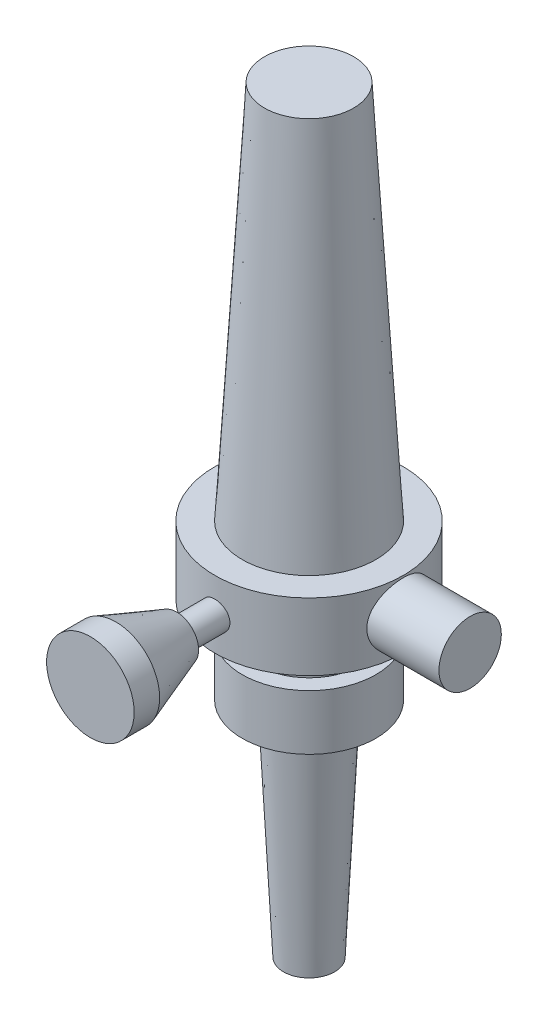
ISO-10303-21;
HEADER;
FILE_DESCRIPTION(('STEP AP214'),'2;1');
FILE_NAME('part.step','',(''),(''),'','','');
FILE_SCHEMA(('AUTOMOTIVE_DESIGN { 1 0 10303 214 1 1 1 1 }'));
ENDSEC;
DATA;
#1=APPLICATION_CONTEXT('core data for automotive mechanical design processes');
#2=APPLICATION_PROTOCOL_DEFINITION('international standard','automotive_design',2000,#1);
#3=PRODUCT_CONTEXT('',#1,'mechanical');
#4=PRODUCT('Part','Part','',(#3));
#5=PRODUCT_RELATED_PRODUCT_CATEGORY('part','',(#4));
#6=PRODUCT_DEFINITION_FORMATION('','',#4);
#7=PRODUCT_DEFINITION_CONTEXT('part definition',#1,'design');
#8=PRODUCT_DEFINITION('design','',#6,#7);
#9=PRODUCT_DEFINITION_SHAPE('','',#8);
#10=(LENGTH_UNIT() NAMED_UNIT(*) SI_UNIT(.MILLI.,.METRE.));
#11=(NAMED_UNIT(*) PLANE_ANGLE_UNIT() SI_UNIT($,.RADIAN.));
#12=(NAMED_UNIT(*) SI_UNIT($,.STERADIAN.) SOLID_ANGLE_UNIT());
#13=UNCERTAINTY_MEASURE_WITH_UNIT(LENGTH_MEASURE(1.E-05),#10,'distance_accuracy_value','');
#14=(GEOMETRIC_REPRESENTATION_CONTEXT(3) GLOBAL_UNCERTAINTY_ASSIGNED_CONTEXT((#13)) GLOBAL_UNIT_ASSIGNED_CONTEXT((#10,
#11,#12)) REPRESENTATION_CONTEXT('',''));
#15=CARTESIAN_POINT('',(0.,0.,0.));
#16=DIRECTION('',(0.,0.,1.));
#17=DIRECTION('',(1.,0.,0.));
#18=AXIS2_PLACEMENT_3D('',#15,#16,#17);
#19=CARTESIAN_POINT('',(0.,0.,0.));
#20=DIRECTION('',(0.,-1.,0.));
#21=DIRECTION('',(0.,0.,-1.));
#22=AXIS2_PLACEMENT_3D('',#19,#20,#21);
#23=CYLINDRICAL_SURFACE('',#22,21.1480362537765);
#24=CARTESIAN_POINT('',(0.,69.6374622356495,0.));
#25=DIRECTION('',(0.,-1.,0.));
#26=DIRECTION('',(0.,0.,-1.));
#27=AXIS2_PLACEMENT_3D('',#24,#25,#26);
#28=CIRCLE('',#27,21.1480362537765);
#29=CARTESIAN_POINT('',(0.,69.6374622356495,-21.1480362537765));
#30=VERTEX_POINT('',#29);
#31=EDGE_CURVE('E97',#30,#30,#28,.T.);
#32=ORIENTED_EDGE('',*,*,#31,.F.);
#33=EDGE_LOOP('',(#32));
#34=FACE_BOUND('',#33,.T.);
#35=CARTESIAN_POINT('',(0.,84.7432024169184,0.));
#36=DIRECTION('',(0.,-1.,0.));
#37=DIRECTION('',(0.,0.,-1.));
#38=AXIS2_PLACEMENT_3D('',#35,#36,#37);
#39=CIRCLE('',#38,21.1480362537765);
#40=CARTESIAN_POINT('',(0.,84.7432024169184,-21.1480362537765));
#41=VERTEX_POINT('',#40);
#42=EDGE_CURVE('E101',#41,#41,#39,.T.);
#43=ORIENTED_EDGE('',*,*,#42,.T.);
#44=EDGE_LOOP('',(#43));
#45=FACE_BOUND('',#44,.T.);
#46=CARTESIAN_POINT('',(19.9559373969514,77.2982046196616,-7.00000000000001));
#47=CARTESIAN_POINT('',(19.9559373637599,77.4888937471689,-7.00000004484916));
#48=CARTESIAN_POINT('',(19.9586779929174,77.6795822624436,-6.9922016010183));
#49=CARTESIAN_POINT('',(19.9695536737059,78.0596018697949,-6.96107993234545));
#50=CARTESIAN_POINT('',(19.9776907054776,78.2489324378032,-6.93775100878092));
#51=CARTESIAN_POINT('',(19.9990979329826,78.6247295937406,-6.87579740289146));
#52=CARTESIAN_POINT('',(20.0123669263519,78.8111968418836,-6.83717630331018));
#53=CARTESIAN_POINT('',(20.0436285211008,79.1800646362831,-6.74498031053922));
#54=CARTESIAN_POINT('',(20.0616229616517,79.3624635690738,-6.69139959446706));
#55=CARTESIAN_POINT('',(20.1017382328248,79.7214653658894,-6.56990377930406));
#56=CARTESIAN_POINT('',(20.1238492537978,79.8980808589257,-6.50202270783766));
#57=CARTESIAN_POINT('',(20.1715876785788,80.2449028196239,-6.35237389394031));
#58=CARTESIAN_POINT('',(20.1972163183844,80.4151070076145,-6.27060126797565));
#59=CARTESIAN_POINT('',(20.2512620809007,80.7480103280121,-6.09379701007682));
#60=CARTESIAN_POINT('',(20.2796791434273,80.9107096222904,-5.99876566429482));
#61=CARTESIAN_POINT('',(20.3385321573016,81.2276714880433,-5.79609170224928));
#62=CARTESIAN_POINT('',(20.3689681891219,81.3819337227836,-5.68844858317102));
#63=CARTESIAN_POINT('',(20.4321530678057,81.6864158496573,-5.45723536209075));
#64=CARTESIAN_POINT('',(20.4649456128122,81.8363024441764,-5.33323807722372));
#65=CARTESIAN_POINT('',(20.5309290902304,82.1251478041543,-5.07329866187998));
#66=CARTESIAN_POINT('',(20.5641198960406,82.2641099415435,-4.93736024478751));
#67=CARTESIAN_POINT('',(20.6300357875734,82.5303732791057,-4.65426563823532));
#68=CARTESIAN_POINT('',(20.6627606292505,82.6576685457874,-4.50710380975606));
#69=CARTESIAN_POINT('',(20.7268438567156,82.8996535177027,-4.20256840370738));
#70=CARTESIAN_POINT('',(20.7582027416977,83.0143478517216,-4.04519860991114));
#71=CARTESIAN_POINT('',(20.8195246610451,83.2332275946416,-3.71691139843195));
#72=CARTESIAN_POINT('',(20.8494297520908,83.3370597759228,-3.54574732704238));
#73=CARTESIAN_POINT('',(20.9060802019251,83.5298369008791,-3.19481185251223));
#74=CARTESIAN_POINT('',(20.9328267297266,83.618787357527,-3.01504366866843));
#75=CARTESIAN_POINT('',(20.9824067913964,83.7810999844541,-2.64807812748758));
#76=CARTESIAN_POINT('',(21.0052403596026,83.8544622915271,-2.4608808353617));
#77=CARTESIAN_POINT('',(21.0463275934686,83.9849306654893,-2.0804165842432));
#78=CARTESIAN_POINT('',(21.0645814522678,84.0420374179349,-1.88714988160167));
#79=CARTESIAN_POINT('',(21.0954288302058,84.1377705129084,-1.50273621475997));
#80=CARTESIAN_POINT('',(21.1081951669636,84.1769640218881,-1.31174428259691));
#81=CARTESIAN_POINT('',(21.1285928555165,84.2393045832623,-0.926890816979917));
#82=CARTESIAN_POINT('',(21.1362244092708,84.2624522667652,-0.733029396693999));
#83=CARTESIAN_POINT('',(21.1461342638489,84.2924706969404,-0.34395463661358));
#84=CARTESIAN_POINT('',(21.1484136860879,84.2993448533557,-0.148741588620104));
#85=CARTESIAN_POINT('',(21.1475569722391,84.296756681366,0.241562029615043));
#86=CARTESIAN_POINT('',(21.1444209595862,84.2872947253124,0.436652602546915));
#87=CARTESIAN_POINT('',(21.1330502234635,84.2528163486098,0.817634618483673));
#88=CARTESIAN_POINT('',(21.125018662614,84.2284195503306,1.00358860806514));
#89=CARTESIAN_POINT('',(21.1042458340637,84.1648382554546,1.37274672971014));
#90=CARTESIAN_POINT('',(21.0915030018603,84.1256488464879,1.55594992724611));
#91=CARTESIAN_POINT('',(21.0616440786545,84.0328420625132,1.91823210436545));
#92=CARTESIAN_POINT('',(21.0445293974661,83.9792293383738,2.09731239322902));
#93=CARTESIAN_POINT('',(21.0063556102135,83.8579948442711,2.45030452587248));
#94=CARTESIAN_POINT('',(20.9852950162514,83.7903677888557,2.62421439126833));
#95=CARTESIAN_POINT('',(20.9394746788614,83.6407040943251,2.96787291117415));
#96=CARTESIAN_POINT('',(20.9146714690165,83.5584958259969,3.1375409823403));
#97=CARTESIAN_POINT('',(20.8621873903389,83.380854172662,3.46941091827831));
#98=CARTESIAN_POINT('',(20.8345055373844,83.2854162610991,3.63161020217272));
#99=CARTESIAN_POINT('',(20.7769617757717,83.0819938863844,3.94754130845921));
#100=CARTESIAN_POINT('',(20.7470997494026,82.9740087456018,4.10127267286785));
#101=CARTESIAN_POINT('',(20.6859364882821,82.7461922172031,4.39938951856267));
#102=CARTESIAN_POINT('',(20.6546352019396,82.6263604047584,4.54377466438042));
#103=CARTESIAN_POINT('',(20.5898903890692,82.3697206287913,4.82889320136418));
#104=CARTESIAN_POINT('',(20.5564150666576,82.2323813519303,4.96914156102592));
#105=CARTESIAN_POINT('',(20.4896606362824,81.9464378687057,5.23759243927183));
#106=CARTESIAN_POINT('',(20.4563814700175,81.7978372124598,5.36579872577825));
#107=CARTESIAN_POINT('',(20.3909136665423,81.4901639644254,5.60945660610016));
#108=CARTESIAN_POINT('',(20.3587256077934,81.3310859455199,5.72490150546052));
#109=CARTESIAN_POINT('',(20.2963872444599,81.003569314128,5.94212675949166));
#110=CARTESIAN_POINT('',(20.2662361472778,80.8351343895197,6.04391244445343));
#111=CARTESIAN_POINT('',(20.2084324139366,80.4874216885632,6.23448144910379));
#112=CARTESIAN_POINT('',(20.1808218535512,80.3080229767062,6.32305715828977));
#113=CARTESIAN_POINT('',(20.1294742890931,79.9419007049154,6.48466607647832));
#114=CARTESIAN_POINT('',(20.1057357774562,79.7551800310457,6.55770533790883));
#115=CARTESIAN_POINT('',(20.0628986145188,79.3757015430293,6.68761687963633));
#116=CARTESIAN_POINT('',(20.0437993328143,79.1829445531536,6.74449135667152));
#117=CARTESIAN_POINT('',(20.0108863460982,78.7928278317901,6.84152736591956));
#118=CARTESIAN_POINT('',(19.9970723730587,78.5954683342427,6.88168974564271));
#119=CARTESIAN_POINT('',(19.9756998085786,78.2065800845066,6.94347701920437));
#120=CARTESIAN_POINT('',(19.967889865247,78.0151834860789,6.96584831938366));
#121=CARTESIAN_POINT('',(19.957789716661,77.6310545463855,6.99473402897629));
#122=CARTESIAN_POINT('',(19.9554993204621,77.4383222515586,7.00124898692786));
#123=CARTESIAN_POINT('',(19.9565137568215,77.0530235910814,6.99835678192027));
#124=CARTESIAN_POINT('',(19.9598177100769,76.8604572041139,6.98895212115882));
#125=CARTESIAN_POINT('',(19.9719101337549,76.4769289910405,6.95432084376154));
#126=CARTESIAN_POINT('',(19.9806985385103,76.2859671457507,6.92909441656514));
#127=CARTESIAN_POINT('',(20.003085405099,75.913512942001,6.86419282679363));
#128=CARTESIAN_POINT('',(20.0165104175256,75.7319192094865,6.82503732992255));
#129=CARTESIAN_POINT('',(20.047815720765,75.3727169342371,6.73252589702901));
#130=CARTESIAN_POINT('',(20.0656974880091,75.1951097334549,6.67916525473421));
#131=CARTESIAN_POINT('',(20.1053930666561,74.8451205381705,6.55870591910714));
#132=CARTESIAN_POINT('',(20.1272059927388,74.6727373773733,6.49161031850786));
#133=CARTESIAN_POINT('',(20.1741670010292,74.3341355999493,6.34416329987665));
#134=CARTESIAN_POINT('',(20.1993163491347,74.1679193539442,6.26380684760506));
#135=CARTESIAN_POINT('',(20.2530898959137,73.8376290610114,6.08773500930357));
#136=CARTESIAN_POINT('',(20.2817976769767,73.6737813546366,5.99162055339831));
#137=CARTESIAN_POINT('',(20.3412526666089,73.3546380817074,5.78655971130735));
#138=CARTESIAN_POINT('',(20.3720005773841,73.1993454938123,5.6776088967749));
#139=CARTESIAN_POINT('',(20.434709909501,72.8982478755281,5.44759351973777));
#140=CARTESIAN_POINT('',(20.4666714360303,72.752443670511,5.32652790571386));
#141=CARTESIAN_POINT('',(20.5309754526817,72.4711697828601,5.0730249286601));
#142=CARTESIAN_POINT('',(20.5633179514474,72.3357003352277,4.94058730718839));
#143=CARTESIAN_POINT('',(20.6290883975114,72.0697017183525,4.65855085393182));
#144=CARTESIAN_POINT('',(20.6624947569551,71.9397144226995,4.50843527784129));
#145=CARTESIAN_POINT('',(20.7278818484522,71.6928667456271,4.19756690649508));
#146=CARTESIAN_POINT('',(20.7598630541424,71.5760019831317,4.03681769002913));
#147=CARTESIAN_POINT('',(20.8215376495565,71.3561398162088,3.7055892415214));
#148=CARTESIAN_POINT('',(20.8512301713903,71.2531476614441,3.53510636062765));
#149=CARTESIAN_POINT('',(20.907471570298,71.0619171244199,3.18565091992499));
#150=CARTESIAN_POINT('',(20.9340217627325,70.9736725624849,3.00668195659526));
#151=CARTESIAN_POINT('',(20.983084615014,70.8131286532845,2.64256081461425));
#152=CARTESIAN_POINT('',(21.0056216927307,70.7407322126224,2.45745477371229));
#153=CARTESIAN_POINT('',(21.0462117730759,70.6118502281801,2.08138337487872));
#154=CARTESIAN_POINT('',(21.0642665649707,70.5553583343147,1.89042038927152));
#155=CARTESIAN_POINT('',(21.095377986611,70.4587875032574,1.50400458249787));
#156=CARTESIAN_POINT('',(21.1084350862752,70.4187070229228,1.30855218529066));
#157=CARTESIAN_POINT('',(21.1291674405928,70.3553537309523,0.914662232441492));
#158=CARTESIAN_POINT('',(21.1368429230297,70.3320802079405,0.716224803507784));
#159=CARTESIAN_POINT('',(21.1463580940051,70.3032639043389,0.327205159928276));
#160=CARTESIAN_POINT('',(21.1484522023549,70.2969480259067,0.136686029378245));
#161=CARTESIAN_POINT('',(21.1474836114066,70.2998741910217,-0.244218361675259));
#162=CARTESIAN_POINT('',(21.1444210122582,70.3091159324203,-0.434603624706769));
#163=CARTESIAN_POINT('',(21.1332230538325,70.3430673258253,-0.81382009702638));
#164=CARTESIAN_POINT('',(21.1250881319468,70.3677756441334,-1.00265143888834));
#165=CARTESIAN_POINT('',(21.1039665099362,70.4324273636597,-1.37741024457641));
#166=CARTESIAN_POINT('',(21.0909797967454,70.4723708059061,-1.56333770058095));
#167=CARTESIAN_POINT('',(21.060742417381,70.566386105284,-1.92809068276906));
#168=CARTESIAN_POINT('',(21.0435619248806,70.6202262067469,-2.10698188769946));
#169=CARTESIAN_POINT('',(21.0052704664872,70.7418883437027,-2.45957525007892));
#170=CARTESIAN_POINT('',(20.9841581841774,70.8097150629242,-2.63327564690435));
#171=CARTESIAN_POINT('',(20.9385421127019,70.9587929216181,-2.97430399140375));
#172=CARTESIAN_POINT('',(20.9140390617907,71.0400411396406,-3.14163331613342));
#173=CARTESIAN_POINT('',(20.8622332515255,71.2154127545409,-3.46902634655464));
#174=CARTESIAN_POINT('',(20.8349294347073,71.3095410189541,-3.62908727482213));
#175=CARTESIAN_POINT('',(20.7771642992392,71.5136525425391,-3.94662640487891));
#176=CARTESIAN_POINT('',(20.7466243733494,71.6240870597535,-4.10380033070715));
#177=CARTESIAN_POINT('',(20.6840401102884,71.857367839146,-4.4084138357924));
#178=CARTESIAN_POINT('',(20.6519952521509,71.9802184166322,-4.55585000096469));
#179=CARTESIAN_POINT('',(20.5872357617519,72.2375384509375,-4.84008395726412));
#180=CARTESIAN_POINT('',(20.5545210453462,72.3720093743598,-4.9768804014007));
#181=CARTESIAN_POINT('',(20.4892785475544,72.6517442535129,-5.23900255332245));
#182=CARTESIAN_POINT('',(20.4567507683797,72.7970083366444,-5.36432812566817));
#183=CARTESIAN_POINT('',(20.3915040837562,73.1032979429075,-5.60735580193406));
#184=CARTESIAN_POINT('',(20.3588265190773,73.2647159136305,-5.72457502369865));
#185=CARTESIAN_POINT('',(20.2955728563247,73.5971966378364,-5.94493914745524));
#186=CARTESIAN_POINT('',(20.2649960172489,73.7682559513057,-6.04808902499806));
#187=CARTESIAN_POINT('',(20.2068524613687,74.1189976352126,-6.23959710495749));
#188=CARTESIAN_POINT('',(20.179286265375,74.2986814898937,-6.32795274952701));
#189=CARTESIAN_POINT('',(20.1280505279008,74.6653526009609,-6.48908084639975));
#190=CARTESIAN_POINT('',(20.1043792289109,74.8523365159256,-6.5618603316755));
#191=CARTESIAN_POINT('',(20.0627503618983,75.2229404402756,-6.68802499635103));
#192=CARTESIAN_POINT('',(20.0445681125482,75.4062694691628,-6.74219133160252));
#193=CARTESIAN_POINT('',(20.0129759763534,75.7770636098071,-6.83539722943484));
#194=CARTESIAN_POINT('',(19.9995641305416,75.9645269901276,-6.87444300186397));
#195=CARTESIAN_POINT('',(19.9779287343544,76.3423001476716,-6.93706719075487));
#196=CARTESIAN_POINT('',(19.9697046907328,76.5326096525292,-6.9606470776921));
#197=CARTESIAN_POINT('',(19.9587090352451,76.9146811832899,-6.99211346976687));
#198=CARTESIAN_POINT('',(19.9559374303296,77.1064432110444,-6.99999995489866));
#199=CARTESIAN_POINT('',(19.9559373969514,77.2982046196616,-7.00000000000001));
#200=B_SPLINE_CURVE_WITH_KNOTS('',3,(#46,#47,#48,#49,#50,#51,#52,#53,#54,#55,#56,#57,#58,#59,
#60,#61,#62,#63,#64,#65,#66,#67,#68,#69,#70,#71,#72,#73,#74,#75,#76,#77,#78,#79,#80,#81,#82,#83,
#84,#85,#86,#87,#88,#89,#90,#91,#92,#93,#94,#95,#96,#97,#98,#99,#100,#101,#102,#103,#104,#105,
#106,#107,#108,#109,#110,#111,#112,#113,#114,#115,#116,#117,#118,#119,#120,#121,#122,#123,#124,
#125,#126,#127,#128,#129,#130,#131,#132,#133,#134,#135,#136,#137,#138,#139,#140,#141,#142,#143,
#144,#145,#146,#147,#148,#149,#150,#151,#152,#153,#154,#155,#156,#157,#158,#159,#160,#161,#162,
#163,#164,#165,#166,#167,#168,#169,#170,#171,#172,#173,#174,#175,#176,#177,#178,#179,#180,#181,
#182,#183,#184,#185,#186,#187,#188,#189,#190,#191,#192,#193,#194,#195,#196,#197,#198,#199),
.UNSPECIFIED.,.T.,.F.,(4,2,2,2,2,2,2,2,2,2,2,2,2,2,2,2,2,2,2,2,2,2,2,2,2,2,2,2,2,2,2,2,2,2,2,2,
2,2,2,2,2,2,2,2,2,2,2,2,2,2,2,2,2,2,2,2,2,2,2,2,2,2,2,2,2,2,2,2,2,2,2,2,2,2,2,2,4),(0.,
0.571888234902402,1.14398643305778,1.71595067581447,2.28813786111064,2.85897860500491,
3.43002044308372,4.00104995873719,4.57210224833401,5.16325059942811,5.7542157650496,
6.3454798327393,6.93652597606646,7.5430275700796,8.14930398413311,8.75557507759277,
9.36182059858849,9.94725216686042,10.5326607078444,11.1179465790811,11.7032191099862,
12.2657160689868,12.8283999880586,13.3909026839645,13.9536179129937,14.5234590158855,
15.093495574831,15.6635629337252,16.2336507429946,16.8303485583596,17.4268590427423,
18.0236809783248,18.6202693321502,19.2254212239314,19.8303369373185,20.4351704054067,
21.039973197208,21.6178210382798,22.195648888856,22.7733859266247,23.3511160470826,
23.9092302604818,24.4675296119714,25.0257033878871,25.5840895537959,26.1597945965385,
26.7356988334651,27.3116531001512,27.8876204595221,28.4909966017767,29.0941706987385,
29.6975724109886,30.300720642736,30.9000633081885,31.4991663382756,32.0982130225837,
32.6972343499901,33.2684419148391,33.8396383862434,34.4107856095967,34.9819343710611,
35.5441126107212,36.1064794148188,36.668723969767,37.2311815940366,37.8140410722809,
38.3971038295677,38.9802402829561,39.5633836206942,40.1690998252135,40.7746012628408,
41.3802072807067,41.985539274764,42.5609338651131,43.1360918960075,43.7111952337241,
44.2862993045753),.UNSPECIFIED.);
#201=CARTESIAN_POINT('',(19.9559373969514,77.2982046196616,-7.00000000000001));
#202=VERTEX_POINT('',#201);
#203=EDGE_CURVE('E10',#202,#202,#200,.T.);
#204=ORIENTED_EDGE('',*,*,#203,.F.);
#205=EDGE_LOOP('',(#204));
#206=FACE_BOUND('',#205,.T.);
#207=CARTESIAN_POINT('',(3.15660290514787,77.,20.9111285082909));
#208=CARTESIAN_POINT('',(3.15659561815266,76.8237550953541,20.9111314430534));
#209=CARTESIAN_POINT('',(3.14179238013829,76.6474076321405,20.9133807791299));
#210=CARTESIAN_POINT('',(3.08298586489755,76.2996424675267,20.9221290814796));
#211=CARTESIAN_POINT('',(3.03895404111873,76.1282297566628,20.9286322021868));
#212=CARTESIAN_POINT('',(2.92303641676126,75.7954182944539,20.9451354737362));
#213=CARTESIAN_POINT('',(2.85117191327396,75.634011995657,20.9551329501879));
#214=CARTESIAN_POINT('',(2.68167890363072,75.3255720065623,20.9774952934079));
#215=CARTESIAN_POINT('',(2.58405397173123,75.1785363262184,20.9898598316813));
#216=CARTESIAN_POINT('',(2.36498459984003,74.9018225747807,21.0156727431713));
#217=CARTESIAN_POINT('',(2.24337618213796,74.7722749645159,21.0291281794309));
#218=CARTESIAN_POINT('',(1.9801459008897,74.5353451683434,21.0555437427238));
#219=CARTESIAN_POINT('',(1.83852294110915,74.4279641973377,21.0685038425771));
#220=CARTESIAN_POINT('',(1.53844844463283,74.2379348905223,21.0925423256586));
#221=CARTESIAN_POINT('',(1.37992006535113,74.1554066275372,21.103611465084));
#222=CARTESIAN_POINT('',(1.05105921586689,74.0181959145224,21.1225426258169));
#223=CARTESIAN_POINT('',(0.880727363904843,73.9635120073158,21.1304048149493));
#224=CARTESIAN_POINT('',(0.53443795047473,73.883937587014,21.141986394629));
#225=CARTESIAN_POINT('',(0.358531610957142,73.8588286575611,21.1457361418988));
#226=CARTESIAN_POINT('',(0.00496519992453659,73.8384387864757,21.1487743722788));
#227=CARTESIAN_POINT('',(-0.172694774472547,73.8431562021838,21.1480631010756));
#228=CARTESIAN_POINT('',(-0.523235303559066,73.8821126596531,21.1422837006926));
#229=CARTESIAN_POINT('',(-0.696142625075254,73.9161167215576,21.137250251241));
#230=CARTESIAN_POINT('',(-1.03376921916685,74.0123124261477,21.1234307013889));
#231=CARTESIAN_POINT('',(-1.19848828256326,74.0745047885275,21.1146445051747));
#232=CARTESIAN_POINT('',(-1.51577433418139,74.2255525368098,21.0942470767375));
#233=CARTESIAN_POINT('',(-1.66829348759005,74.3145069330423,21.0826253848681));
#234=CARTESIAN_POINT('',(-1.95632866982524,74.5164813800213,21.0578523508563));
#235=CARTESIAN_POINT('',(-2.09184358931884,74.6295029995846,21.0447009090229));
#236=CARTESIAN_POINT('',(-2.34340850928457,74.8777128622518,21.0181840437082));
#237=CARTESIAN_POINT('',(-2.45925610544471,75.0131062500736,21.0048177836151));
#238=CARTESIAN_POINT('',(-2.66661760267988,75.301519097125,20.9795027219852));
#239=CARTESIAN_POINT('',(-2.75813135667991,75.4545386628802,20.9675539290158));
#240=CARTESIAN_POINT('',(-2.91425428040746,75.7740702060529,20.946426922249));
#241=CARTESIAN_POINT('',(-2.97884279078541,75.9405924272753,20.9372508373901));
#242=CARTESIAN_POINT('',(-3.07907892377579,76.2822885265972,20.9227459868142));
#243=CARTESIAN_POINT('',(-3.11472856502316,76.4574618003368,20.9174169527483));
#244=CARTESIAN_POINT('',(-3.15579770740607,76.8096870778704,20.911260407916));
#245=CARTESIAN_POINT('',(-3.16150406434059,76.9867049139641,20.9103901837856));
#246=CARTESIAN_POINT('',(-3.14328567877124,77.3391691390119,20.9131364003412));
#247=CARTESIAN_POINT('',(-3.11936184635394,77.5146155760645,20.9167527032243));
#248=CARTESIAN_POINT('',(-3.04280542740144,77.8580689548481,20.9280252779169));
#249=CARTESIAN_POINT('',(-2.99031562660186,78.0261084411719,20.9356614504289));
#250=CARTESIAN_POINT('',(-2.8582657447616,78.3510039974965,20.9540967912148));
#251=CARTESIAN_POINT('',(-2.77870433890902,78.5078595197295,20.9648961142812));
#252=CARTESIAN_POINT('',(-2.59407998122094,78.8072208659629,20.9885416257683));
#253=CARTESIAN_POINT('',(-2.4888312618017,78.9496109436861,21.0014024792195));
#254=CARTESIAN_POINT('',(-2.25607828652748,79.214809902205,21.0276777267036));
#255=CARTESIAN_POINT('',(-2.12857278496306,79.3376176862456,21.0410921516879));
#256=CARTESIAN_POINT('',(-1.85366268057009,79.5611954724183,21.0670964930156));
#257=CARTESIAN_POINT('',(-1.70610267521455,79.6617754215009,21.0796786992393));
#258=CARTESIAN_POINT('',(-1.3960145078139,79.8367186074187,21.1024812568221));
#259=CARTESIAN_POINT('',(-1.23348675212792,79.9110825557271,21.1127016722751));
#260=CARTESIAN_POINT('',(-0.89867123894857,80.0311788273532,21.1295952873022));
#261=CARTESIAN_POINT('',(-0.72642150014241,80.0770152538284,21.1362813708011));
#262=CARTESIAN_POINT('',(-0.376562759130554,80.1390923166326,21.1454070450185));
#263=CARTESIAN_POINT('',(-0.198954108028639,80.1553348876222,21.1478469133276));
#264=CARTESIAN_POINT('',(0.154737094419473,80.1577163069927,21.1482025154681));
#265=CARTESIAN_POINT('',(0.330817712559633,80.1441460234422,21.1461619624816));
#266=CARTESIAN_POINT('',(0.678163567882318,80.0879101684481,21.1378741071882));
#267=CARTESIAN_POINT('',(0.849428820031274,80.0452446874444,21.1316268179574));
#268=CARTESIAN_POINT('',(1.18220379507333,79.9321323737831,21.1156241986484));
#269=CARTESIAN_POINT('',(1.34372042584328,79.8617054858251,21.1058713874938));
#270=CARTESIAN_POINT('',(1.65268987294548,79.6951005144503,21.0839292152503));
#271=CARTESIAN_POINT('',(1.80014224150527,79.5989216115218,21.0717397766231));
#272=CARTESIAN_POINT('',(2.0782731849222,79.3824902397264,21.0461382039989));
#273=CARTESIAN_POINT('',(2.2087836646891,79.2620229526667,21.0327157866146));
#274=CARTESIAN_POINT('',(2.44784302754985,79.0008863183046,21.0062373096908));
#275=CARTESIAN_POINT('',(2.55638674795773,78.8602122351989,20.9931813368937));
#276=CARTESIAN_POINT('',(2.74897265273618,78.5617360841632,20.9688361529222));
#277=CARTESIAN_POINT('',(2.83287524389678,78.4038431278149,20.9575571692333));
#278=CARTESIAN_POINT('',(2.97284495533496,78.076112652969,20.9381629276198));
#279=CARTESIAN_POINT('',(3.02894100701228,77.9062877600989,20.9300443833028));
#280=CARTESIAN_POINT('',(3.09895203054124,77.6130803666955,20.9197689540483));
#281=CARTESIAN_POINT('',(3.12053809326924,77.4915100949389,20.9165459330653));
#282=CARTESIAN_POINT('',(3.1493659889536,77.2466432786154,20.9122246967875));
#283=CARTESIAN_POINT('',(3.15660800502422,77.1233467561059,20.9111264543681));
#284=CARTESIAN_POINT('',(3.15660290514787,77.,20.9111285082909));
#285=B_SPLINE_CURVE_WITH_KNOTS('',3,(#207,#208,#209,#210,#211,#212,#213,#214,#215,#216,#217,
#218,#219,#220,#221,#222,#223,#224,#225,#226,#227,#228,#229,#230,#231,#232,#233,#234,#235,#236,
#237,#238,#239,#240,#241,#242,#243,#244,#245,#246,#247,#248,#249,#250,#251,#252,#253,#254,#255,
#256,#257,#258,#259,#260,#261,#262,#263,#264,#265,#266,#267,#268,#269,#270,#271,#272,#273,#274,
#275,#276,#277,#278,#279,#280,#281,#282,#283,#284),.UNSPECIFIED.,.T.,.F.,(4,2,2,2,2,2,2,2,2,2,2,
2,2,2,2,2,2,2,2,2,2,2,2,2,2,2,2,2,2,2,2,2,2,2,2,2,2,2,4),(0.,0.528283875049706,1.05708446738368,
1.58548122742744,2.11380471099789,2.64587412152167,3.17797268579706,3.71260223116601,
4.24720379492446,4.77783197300565,5.30843092746537,5.83481189314581,6.36120629896448,
6.8895726457296,7.41797344449002,7.9515199114544,8.48506960312795,9.01902792958568,
9.55294900650278,10.0817456712672,10.6105260945288,11.1366873884863,11.6628744350735,
12.1929858365818,12.7231269178806,13.2576390798445,13.7921367346246,14.3246722749929,
14.8571730002804,15.3845014928695,15.9118283463105,16.4387770394155,16.9657425037098,
17.4975910742348,18.02956449643,18.5644958810669,19.0988695203053,19.4685989844759,
19.838323728697),.UNSPECIFIED.);
#286=CARTESIAN_POINT('',(3.15660290514787,77.,20.9111285082909));
#287=VERTEX_POINT('',#286);
#288=EDGE_CURVE('E41',#287,#287,#285,.T.);
#289=ORIENTED_EDGE('',*,*,#288,.T.);
#290=EDGE_LOOP('',(#289));
#291=FACE_BOUND('',#290,.T.);
#292=ADVANCED_FACE('F37',(#34,#45,#206,#291),#23,.T.);
#293=CARTESIAN_POINT('',(0.,0.,0.));
#294=DIRECTION('',(0.,-1.,0.));
#295=DIRECTION('',(0.,0.,-1.));
#296=AXIS2_PLACEMENT_3D('',#293,#294,#295);
#297=PLANE('',#296);
#298=CARTESIAN_POINT('',(0.,0.,0.));
#299=DIRECTION('',(0.,-1.,0.));
#300=DIRECTION('',(0.,0.,-1.));
#301=AXIS2_PLACEMENT_3D('',#298,#299,#300);
#302=CIRCLE('',#301,5.74018126888216);
#303=CARTESIAN_POINT('',(0.,0.,-5.74018126888216));
#304=VERTEX_POINT('',#303);
#305=EDGE_CURVE('E49',#304,#304,#302,.T.);
#306=ORIENTED_EDGE('',*,*,#305,.T.);
#307=EDGE_LOOP('',(#306));
#308=FACE_BOUND('',#307,.T.);
#309=ADVANCED_FACE('F39',(#308),#297,.T.);
#310=CARTESIAN_POINT('',(0.,0.,0.));
#311=DIRECTION('',(0.,1.,0.));
#312=DIRECTION('',(0.,0.,1.));
#313=AXIS2_PLACEMENT_3D('',#310,#311,#312);
#314=CONICAL_SURFACE('',#313,5.74018126888216,0.0483007721648254);
#315=CARTESIAN_POINT('',(0.,50.,0.));
#316=DIRECTION('',(0.,-1.,0.));
#317=DIRECTION('',(0.,0.,-1.));
#318=AXIS2_PLACEMENT_3D('',#315,#316,#317);
#319=CIRCLE('',#318,8.15709969788525);
#320=CARTESIAN_POINT('',(0.,50.,-8.15709969788525));
#321=VERTEX_POINT('',#320);
#322=EDGE_CURVE('E53',#321,#321,#319,.T.);
#323=ORIENTED_EDGE('',*,*,#322,.T.);
#324=EDGE_LOOP('',(#323));
#325=FACE_BOUND('',#324,.T.);
#326=ORIENTED_EDGE('',*,*,#305,.F.);
#327=EDGE_LOOP('',(#326));
#328=FACE_BOUND('',#327,.T.);
#329=ADVANCED_FACE('F92',(#325,#328),#314,.T.);
#330=CARTESIAN_POINT('',(8.15709969788525,50.,0.));
#331=DIRECTION('',(0.,-1.,0.));
#332=DIRECTION('',(0.,0.,-1.));
#333=AXIS2_PLACEMENT_3D('',#330,#331,#332);
#334=PLANE('',#333);
#335=CARTESIAN_POINT('',(0.,50.,0.));
#336=DIRECTION('',(0.,-1.,0.));
#337=DIRECTION('',(0.,0.,-1.));
#338=AXIS2_PLACEMENT_3D('',#335,#336,#337);
#339=CIRCLE('',#338,15.);
#340=CARTESIAN_POINT('',(0.,50.,-15.));
#341=VERTEX_POINT('',#340);
#342=EDGE_CURVE('E136',#341,#341,#339,.T.);
#343=ORIENTED_EDGE('',*,*,#342,.T.);
#344=EDGE_LOOP('',(#343));
#345=FACE_BOUND('',#344,.T.);
#346=ORIENTED_EDGE('',*,*,#322,.F.);
#347=EDGE_LOOP('',(#346));
#348=FACE_BOUND('',#347,.T.);
#349=ADVANCED_FACE('F143',(#345,#348),#334,.T.);
#350=CARTESIAN_POINT('',(0.,0.,0.));
#351=DIRECTION('',(0.,-1.,0.));
#352=DIRECTION('',(0.,0.,-1.));
#353=AXIS2_PLACEMENT_3D('',#350,#351,#352);
#354=CYLINDRICAL_SURFACE('',#353,15.);
#355=CARTESIAN_POINT('',(0.,62.3867069486405,0.));
#356=DIRECTION('',(0.,-1.,0.));
#357=DIRECTION('',(0.,0.,-1.));
#358=AXIS2_PLACEMENT_3D('',#355,#356,#357);
#359=CIRCLE('',#358,15.);
#360=CARTESIAN_POINT('',(0.,62.3867069486405,-15.));
#361=VERTEX_POINT('',#360);
#362=EDGE_CURVE('E133',#361,#361,#359,.T.);
#363=ORIENTED_EDGE('',*,*,#362,.T.);
#364=EDGE_LOOP('',(#363));
#365=FACE_BOUND('',#364,.T.);
#366=ORIENTED_EDGE('',*,*,#342,.F.);
#367=EDGE_LOOP('',(#366));
#368=FACE_BOUND('',#367,.T.);
#369=ADVANCED_FACE('F145',(#365,#368),#354,.T.);
#370=CARTESIAN_POINT('',(15.,62.3867069486405,0.));
#371=DIRECTION('',(0.,1.,0.));
#372=DIRECTION('',(0.,0.,1.));
#373=AXIS2_PLACEMENT_3D('',#370,#371,#372);
#374=PLANE('',#373);
#375=CARTESIAN_POINT('',(0.,62.3867069486405,0.));
#376=DIRECTION('',(0.,-1.,0.));
#377=DIRECTION('',(0.,0.,-1.));
#378=AXIS2_PLACEMENT_3D('',#375,#376,#377);
#379=CIRCLE('',#378,11.4803625377644);
#380=CARTESIAN_POINT('',(0.,62.3867069486405,-11.4803625377644));
#381=VERTEX_POINT('',#380);
#382=EDGE_CURVE('E130',#381,#381,#379,.T.);
#383=ORIENTED_EDGE('',*,*,#382,.T.);
#384=EDGE_LOOP('',(#383));
#385=FACE_BOUND('',#384,.T.);
#386=ORIENTED_EDGE('',*,*,#362,.F.);
#387=EDGE_LOOP('',(#386));
#388=FACE_BOUND('',#387,.T.);
#389=ADVANCED_FACE('F152',(#385,#388),#374,.T.);
#390=CARTESIAN_POINT('',(0.,0.,0.));
#391=DIRECTION('',(0.,-1.,0.));
#392=DIRECTION('',(0.,0.,-1.));
#393=AXIS2_PLACEMENT_3D('',#390,#391,#392);
#394=CYLINDRICAL_SURFACE('',#393,11.4803625377644);
#395=CARTESIAN_POINT('',(0.,69.6374622356495,0.));
#396=DIRECTION('',(0.,-1.,0.));
#397=DIRECTION('',(0.,0.,-1.));
#398=AXIS2_PLACEMENT_3D('',#395,#396,#397);
#399=CIRCLE('',#398,11.4803625377644);
#400=CARTESIAN_POINT('',(0.,69.6374622356495,-11.4803625377644));
#401=VERTEX_POINT('',#400);
#402=EDGE_CURVE('E127',#401,#401,#399,.T.);
#403=ORIENTED_EDGE('',*,*,#402,.T.);
#404=EDGE_LOOP('',(#403));
#405=FACE_BOUND('',#404,.T.);
#406=ORIENTED_EDGE('',*,*,#382,.F.);
#407=EDGE_LOOP('',(#406));
#408=FACE_BOUND('',#407,.T.);
#409=ADVANCED_FACE('F83',(#405,#408),#394,.T.);
#410=CARTESIAN_POINT('',(11.4803625377644,69.6374622356495,0.));
#411=DIRECTION('',(0.,-1.,0.));
#412=DIRECTION('',(0.,0.,-1.));
#413=AXIS2_PLACEMENT_3D('',#410,#411,#412);
#414=PLANE('',#413);
#415=ORIENTED_EDGE('',*,*,#31,.T.);
#416=EDGE_LOOP('',(#415));
#417=FACE_BOUND('',#416,.T.);
#418=ORIENTED_EDGE('',*,*,#402,.F.);
#419=EDGE_LOOP('',(#418));
#420=FACE_BOUND('',#419,.T.);
#421=ADVANCED_FACE('F78',(#417,#420),#414,.T.);
#422=CARTESIAN_POINT('',(21.1480362537765,84.7432024169184,0.));
#423=DIRECTION('',(0.,1.,0.));
#424=DIRECTION('',(0.,0.,1.));
#425=AXIS2_PLACEMENT_3D('',#422,#423,#424);
#426=PLANE('',#425);
#427=CARTESIAN_POINT('',(0.,84.7432024169184,0.));
#428=DIRECTION('',(0.,-1.,0.));
#429=DIRECTION('',(0.,0.,-1.));
#430=AXIS2_PLACEMENT_3D('',#427,#428,#429);
#431=CIRCLE('',#430,15.);
#432=CARTESIAN_POINT('',(0.,84.7432024169184,-15.));
#433=VERTEX_POINT('',#432);
#434=EDGE_CURVE('E123',#433,#433,#431,.T.);
#435=ORIENTED_EDGE('',*,*,#434,.T.);
#436=EDGE_LOOP('',(#435));
#437=FACE_BOUND('',#436,.T.);
#438=ORIENTED_EDGE('',*,*,#42,.F.);
#439=EDGE_LOOP('',(#438));
#440=FACE_BOUND('',#439,.T.);
#441=ADVANCED_FACE('F75',(#437,#440),#426,.T.);
#442=CARTESIAN_POINT('',(0.,84.7432024169184,0.));
#443=DIRECTION('',(0.,-1.,0.));
#444=DIRECTION('',(0.,0.,-1.));
#445=AXIS2_PLACEMENT_3D('',#442,#443,#444);
#446=CONICAL_SURFACE('',#445,15.,0.0585792525412991);
#447=CARTESIAN_POINT('',(0.,170.,0.));
#448=DIRECTION('',(0.,-1.,0.));
#449=DIRECTION('',(0.,0.,-1.));
#450=AXIS2_PLACEMENT_3D('',#447,#448,#449);
#451=CIRCLE('',#450,10.);
#452=CARTESIAN_POINT('',(0.,170.,-10.));
#453=VERTEX_POINT('',#452);
#454=EDGE_CURVE('E109',#453,#453,#451,.T.);
#455=ORIENTED_EDGE('',*,*,#454,.T.);
#456=EDGE_LOOP('',(#455));
#457=FACE_BOUND('',#456,.T.);
#458=ORIENTED_EDGE('',*,*,#434,.F.);
#459=EDGE_LOOP('',(#458));
#460=FACE_BOUND('',#459,.T.);
#461=ADVANCED_FACE('F72',(#457,#460),#446,.T.);
#462=CARTESIAN_POINT('',(10.,170.,0.));
#463=DIRECTION('',(0.,1.,0.));
#464=DIRECTION('',(0.,0.,1.));
#465=AXIS2_PLACEMENT_3D('',#462,#463,#464);
#466=PLANE('',#465);
#467=ORIENTED_EDGE('',*,*,#454,.F.);
#468=EDGE_LOOP('',(#467));
#469=FACE_BOUND('',#468,.T.);
#470=ADVANCED_FACE('F68',(#469),#466,.T.);
#471=CARTESIAN_POINT('',(16.1480362537765,77.2982046196616,0.));
#472=DIRECTION('',(1.,0.,0.));
#473=DIRECTION('',(0.,0.,-1.));
#474=AXIS2_PLACEMENT_3D('',#471,#472,#473);
#475=CYLINDRICAL_SURFACE('',#474,7.);
#476=ORIENTED_EDGE('',*,*,#203,.T.);
#477=EDGE_LOOP('',(#476));
#478=FACE_BOUND('',#477,.T.);
#479=CARTESIAN_POINT('',(36.1480362537765,77.2982046196616,0.));
#480=DIRECTION('',(1.,0.,0.));
#481=DIRECTION('',(0.,0.,-1.));
#482=AXIS2_PLACEMENT_3D('',#479,#480,#481);
#483=CIRCLE('',#482,7.);
#484=CARTESIAN_POINT('',(36.1480362537765,77.2982046196616,-7.00000000000001));
#485=VERTEX_POINT('',#484);
#486=EDGE_CURVE('E106',#485,#485,#483,.T.);
#487=ORIENTED_EDGE('',*,*,#486,.F.);
#488=EDGE_LOOP('',(#487));
#489=FACE_BOUND('',#488,.T.);
#490=ADVANCED_FACE('F62',(#478,#489),#475,.T.);
#491=CARTESIAN_POINT('',(36.1480362537765,77.2982046196616,0.));
#492=DIRECTION('',(1.,0.,0.));
#493=DIRECTION('',(0.,0.,-1.));
#494=AXIS2_PLACEMENT_3D('',#491,#492,#493);
#495=PLANE('',#494);
#496=ORIENTED_EDGE('',*,*,#486,.T.);
#497=EDGE_LOOP('',(#496));
#498=FACE_BOUND('',#497,.T.);
#499=ADVANCED_FACE('F67',(#498),#495,.T.);
#500=CARTESIAN_POINT('',(0.,77.,49.0691705675177));
#501=DIRECTION('',(0.,0.,-1.));
#502=DIRECTION('',(-1.,0.,0.));
#503=AXIS2_PLACEMENT_3D('',#500,#501,#502);
#504=PLANE('',#503);
#505=CARTESIAN_POINT('',(0.,77.,49.0691705675177));
#506=DIRECTION('',(0.,0.,1.));
#507=DIRECTION('',(1.,0.,0.));
#508=AXIS2_PLACEMENT_3D('',#505,#506,#507);
#509=CIRCLE('',#508,9.82619890461629);
#510=CARTESIAN_POINT('',(9.82619890461629,77.,49.0691705675177));
#511=VERTEX_POINT('',#510);
#512=EDGE_CURVE('E107',#511,#511,#509,.T.);
#513=ORIENTED_EDGE('',*,*,#512,.T.);
#514=EDGE_LOOP('',(#513));
#515=FACE_BOUND('',#514,.T.);
#516=ADVANCED_FACE('F207',(#515),#504,.F.);
#517=CARTESIAN_POINT('',(0.,77.,70.0307579944185));
#518=DIRECTION('',(0.,0.,1.));
#519=DIRECTION('',(1.,0.,0.));
#520=AXIS2_PLACEMENT_3D('',#517,#518,#519);
#521=CYLINDRICAL_SURFACE('',#520,9.82619890461629);
#522=ORIENTED_EDGE('',*,*,#512,.F.);
#523=EDGE_LOOP('',(#522));
#524=FACE_BOUND('',#523,.T.);
#525=CARTESIAN_POINT('',(0.,77.,43.3523739965448));
#526=DIRECTION('',(0.,0.,1.));
#527=DIRECTION('',(1.,0.,0.));
#528=AXIS2_PLACEMENT_3D('',#525,#526,#527);
#529=CIRCLE('',#528,9.82619890461629);
#530=CARTESIAN_POINT('',(9.82619890461629,77.,43.3523739965448));
#531=VERTEX_POINT('',#530);
#532=EDGE_CURVE('E112',#531,#531,#529,.T.);
#533=ORIENTED_EDGE('',*,*,#532,.T.);
#534=EDGE_LOOP('',(#533));
#535=FACE_BOUND('',#534,.T.);
#536=ADVANCED_FACE('F221',(#524,#535),#521,.T.);
#537=CARTESIAN_POINT('',(0.,77.,29.6955821881094));
#538=DIRECTION('',(0.,0.,1.));
#539=DIRECTION('',(1.,0.,0.));
#540=AXIS2_PLACEMENT_3D('',#537,#538,#539);
#541=CONICAL_SURFACE('',#540,4.91309945230815,0.345338693153405);
#542=ORIENTED_EDGE('',*,*,#532,.F.);
#543=EDGE_LOOP('',(#542));
#544=FACE_BOUND('',#543,.T.);
#545=CARTESIAN_POINT('',(0.,77.,29.6955821881094));
#546=DIRECTION('',(0.,0.,1.));
#547=DIRECTION('',(1.,0.,0.));
#548=AXIS2_PLACEMENT_3D('',#545,#546,#547);
#549=CIRCLE('',#548,4.91309945230815);
#550=CARTESIAN_POINT('',(4.91309945230815,77.,29.6955821881094));
#551=VERTEX_POINT('',#550);
#552=EDGE_CURVE('E117',#551,#551,#549,.T.);
#553=ORIENTED_EDGE('',*,*,#552,.T.);
#554=EDGE_LOOP('',(#553));
#555=FACE_BOUND('',#554,.T.);
#556=ADVANCED_FACE('F229',(#544,#555),#541,.T.);
#557=CARTESIAN_POINT('',(0.,81.9130994523081,29.6955821881094));
#558=DIRECTION('',(0.,0.,1.));
#559=DIRECTION('',(1.,0.,0.));
#560=AXIS2_PLACEMENT_3D('',#557,#558,#559);
#561=PLANE('',#560);
#562=ORIENTED_EDGE('',*,*,#552,.F.);
#563=EDGE_LOOP('',(#562));
#564=FACE_BOUND('',#563,.T.);
#565=CARTESIAN_POINT('',(0.,77.,29.6955821881094));
#566=DIRECTION('',(0.,0.,1.));
#567=DIRECTION('',(1.,0.,0.));
#568=AXIS2_PLACEMENT_3D('',#565,#566,#567);
#569=CIRCLE('',#568,3.15660290514787);
#570=CARTESIAN_POINT('',(3.15660290514787,77.,29.6955821881094));
#571=VERTEX_POINT('',#570);
#572=EDGE_CURVE('E265',#571,#571,#569,.T.);
#573=ORIENTED_EDGE('',*,*,#572,.T.);
#574=EDGE_LOOP('',(#573));
#575=FACE_BOUND('',#574,.T.);
#576=ADVANCED_FACE('F239',(#564,#575),#561,.F.);
#577=CARTESIAN_POINT('',(0.,77.,70.0307579944185));
#578=DIRECTION('',(0.,0.,1.));
#579=DIRECTION('',(1.,0.,0.));
#580=AXIS2_PLACEMENT_3D('',#577,#578,#579);
#581=CYLINDRICAL_SURFACE('',#580,3.15660290514787);
#582=ORIENTED_EDGE('',*,*,#288,.F.);
#583=EDGE_LOOP('',(#582));
#584=FACE_BOUND('',#583,.T.);
#585=ORIENTED_EDGE('',*,*,#572,.F.);
#586=EDGE_LOOP('',(#585));
#587=FACE_BOUND('',#586,.T.);
#588=ADVANCED_FACE('F249',(#584,#587),#581,.T.);
#589=CLOSED_SHELL('',(#292,#309,#329,#349,#369,#389,#409,#421,#441,#461,#470,#490,#499,#516,
#536,#556,#576,#588));
#590=MANIFOLD_SOLID_BREP('B2',#589);
#591=ADVANCED_BREP_SHAPE_REPRESENTATION('',(#18,#590),#14);
#592=SHAPE_DEFINITION_REPRESENTATION(#9,#591);
ENDSEC;
END-ISO-10303-21;
